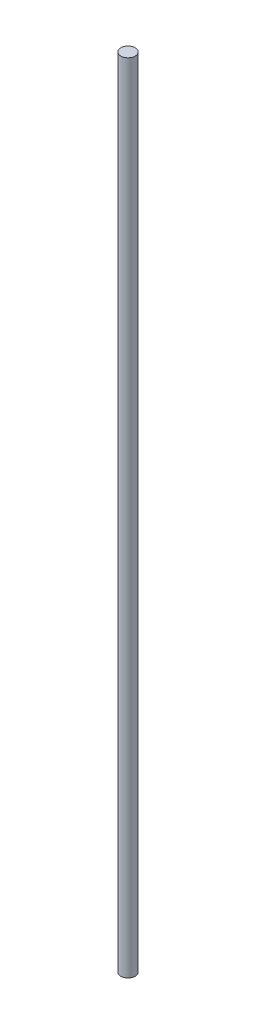
ISO-10303-21;
HEADER;
FILE_DESCRIPTION(('STEP AP214'),'2;1');
FILE_NAME('part.step','',(''),(''),'','','');
FILE_SCHEMA(('AUTOMOTIVE_DESIGN { 1 0 10303 214 1 1 1 1 }'));
ENDSEC;
DATA;
#1=APPLICATION_CONTEXT('core data for automotive mechanical design processes');
#2=APPLICATION_PROTOCOL_DEFINITION('international standard','automotive_design',2000,#1);
#3=PRODUCT_CONTEXT('',#1,'mechanical');
#4=PRODUCT('Part','Part','',(#3));
#5=PRODUCT_RELATED_PRODUCT_CATEGORY('part','',(#4));
#6=PRODUCT_DEFINITION_FORMATION('','',#4);
#7=PRODUCT_DEFINITION_CONTEXT('part definition',#1,'design');
#8=PRODUCT_DEFINITION('design','',#6,#7);
#9=PRODUCT_DEFINITION_SHAPE('','',#8);
#10=(LENGTH_UNIT() NAMED_UNIT(*) SI_UNIT(.MILLI.,.METRE.));
#11=(NAMED_UNIT(*) PLANE_ANGLE_UNIT() SI_UNIT($,.RADIAN.));
#12=(NAMED_UNIT(*) SI_UNIT($,.STERADIAN.) SOLID_ANGLE_UNIT());
#13=UNCERTAINTY_MEASURE_WITH_UNIT(LENGTH_MEASURE(1.E-05),#10,'distance_accuracy_value','');
#14=(GEOMETRIC_REPRESENTATION_CONTEXT(3) GLOBAL_UNCERTAINTY_ASSIGNED_CONTEXT((#13)) GLOBAL_UNIT_ASSIGNED_CONTEXT((#10,
#11,#12)) REPRESENTATION_CONTEXT('',''));
#15=CARTESIAN_POINT('',(0.,0.,0.));
#16=DIRECTION('',(0.,0.,1.));
#17=DIRECTION('',(1.,0.,0.));
#18=AXIS2_PLACEMENT_3D('',#15,#16,#17);
#19=CARTESIAN_POINT('',(0.,350.,0.));
#20=DIRECTION('',(0.,-1.,0.));
#21=DIRECTION('',(0.,0.,-1.));
#22=AXIS2_PLACEMENT_3D('',#19,#20,#21);
#23=CYLINDRICAL_SURFACE('',#22,3.175);
#24=CARTESIAN_POINT('',(0.,350.,0.));
#25=DIRECTION('',(0.,1.,0.));
#26=DIRECTION('',(0.,0.,1.));
#27=AXIS2_PLACEMENT_3D('',#24,#25,#26);
#28=CIRCLE('',#27,3.175);
#29=CARTESIAN_POINT('',(0.,350.,3.175));
#30=VERTEX_POINT('',#29);
#31=EDGE_CURVE('E10',#30,#30,#28,.T.);
#32=ORIENTED_EDGE('',*,*,#31,.F.);
#33=EDGE_LOOP('',(#32));
#34=FACE_BOUND('',#33,.T.);
#35=CARTESIAN_POINT('',(0.,0.,0.));
#36=DIRECTION('',(0.,1.,0.));
#37=DIRECTION('',(0.,0.,1.));
#38=AXIS2_PLACEMENT_3D('',#35,#36,#37);
#39=CIRCLE('',#38,3.175);
#40=CARTESIAN_POINT('',(0.,0.,3.175));
#41=VERTEX_POINT('',#40);
#42=EDGE_CURVE('E34',#41,#41,#39,.T.);
#43=ORIENTED_EDGE('',*,*,#42,.T.);
#44=EDGE_LOOP('',(#43));
#45=FACE_BOUND('',#44,.T.);
#46=ADVANCED_FACE('F31',(#34,#45),#23,.T.);
#47=CARTESIAN_POINT('',(0.,350.,0.));
#48=DIRECTION('',(0.,1.,0.));
#49=DIRECTION('',(0.,0.,1.));
#50=AXIS2_PLACEMENT_3D('',#47,#48,#49);
#51=PLANE('',#50);
#52=ORIENTED_EDGE('',*,*,#31,.T.);
#53=EDGE_LOOP('',(#52));
#54=FACE_BOUND('',#53,.T.);
#55=ADVANCED_FACE('F46',(#54),#51,.T.);
#56=CARTESIAN_POINT('',(0.,0.,0.));
#57=DIRECTION('',(0.,1.,0.));
#58=DIRECTION('',(0.,0.,1.));
#59=AXIS2_PLACEMENT_3D('',#56,#57,#58);
#60=PLANE('',#59);
#61=ORIENTED_EDGE('',*,*,#42,.F.);
#62=EDGE_LOOP('',(#61));
#63=FACE_BOUND('',#62,.T.);
#64=ADVANCED_FACE('F44',(#63),#60,.F.);
#65=CLOSED_SHELL('',(#46,#55,#64));
#66=MANIFOLD_SOLID_BREP('B2',#65);
#67=ADVANCED_BREP_SHAPE_REPRESENTATION('',(#18,#66),#14);
#68=SHAPE_DEFINITION_REPRESENTATION(#9,#67);
ENDSEC;
END-ISO-10303-21;
